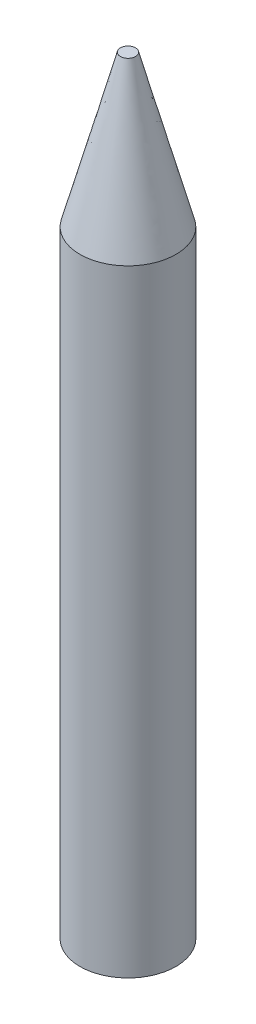
ISO-10303-21;
HEADER;
FILE_DESCRIPTION(('STEP AP214'),'2;1');
FILE_NAME('part.step','',(''),(''),'','','');
FILE_SCHEMA(('AUTOMOTIVE_DESIGN { 1 0 10303 214 1 1 1 1 }'));
ENDSEC;
DATA;
#1=APPLICATION_CONTEXT('core data for automotive mechanical design processes');
#2=APPLICATION_PROTOCOL_DEFINITION('international standard','automotive_design',2000,#1);
#3=PRODUCT_CONTEXT('',#1,'mechanical');
#4=PRODUCT('Part','Part','',(#3));
#5=PRODUCT_RELATED_PRODUCT_CATEGORY('part','',(#4));
#6=PRODUCT_DEFINITION_FORMATION('','',#4);
#7=PRODUCT_DEFINITION_CONTEXT('part definition',#1,'design');
#8=PRODUCT_DEFINITION('design','',#6,#7);
#9=PRODUCT_DEFINITION_SHAPE('','',#8);
#10=(LENGTH_UNIT() NAMED_UNIT(*) SI_UNIT(.MILLI.,.METRE.));
#11=(NAMED_UNIT(*) PLANE_ANGLE_UNIT() SI_UNIT($,.RADIAN.));
#12=(NAMED_UNIT(*) SI_UNIT($,.STERADIAN.) SOLID_ANGLE_UNIT());
#13=UNCERTAINTY_MEASURE_WITH_UNIT(LENGTH_MEASURE(1.E-05),#10,'distance_accuracy_value','');
#14=(GEOMETRIC_REPRESENTATION_CONTEXT(3) GLOBAL_UNCERTAINTY_ASSIGNED_CONTEXT((#13)) GLOBAL_UNIT_ASSIGNED_CONTEXT((#10,
#11,#12)) REPRESENTATION_CONTEXT('',''));
#15=CARTESIAN_POINT('',(0.,0.,0.));
#16=DIRECTION('',(0.,0.,1.));
#17=DIRECTION('',(1.,0.,0.));
#18=AXIS2_PLACEMENT_3D('',#15,#16,#17);
#19=CARTESIAN_POINT('',(0.,40.8,0.));
#20=DIRECTION('',(0.,-1.,0.));
#21=DIRECTION('',(0.,0.,-1.));
#22=AXIS2_PLACEMENT_3D('',#19,#20,#21);
#23=CYLINDRICAL_SURFACE('',#22,3.175);
#24=CARTESIAN_POINT('',(0.,40.8,0.));
#25=DIRECTION('',(0.,-1.,0.));
#26=DIRECTION('',(0.,0.,-1.));
#27=AXIS2_PLACEMENT_3D('',#24,#25,#26);
#28=CIRCLE('',#27,3.175);
#29=CARTESIAN_POINT('',(1.16879545477385,40.8,2.9520403426952));
#30=VERTEX_POINT('',#29);
#31=EDGE_CURVE('E11',#30,#30,#28,.F.);
#32=ORIENTED_EDGE('',*,*,#31,.F.);
#33=EDGE_LOOP('',(#32));
#34=FACE_BOUND('',#33,.T.);
#35=CARTESIAN_POINT('',(0.,0.,0.));
#36=DIRECTION('',(0.,1.,0.));
#37=DIRECTION('',(0.,0.,1.));
#38=AXIS2_PLACEMENT_3D('',#35,#36,#37);
#39=CIRCLE('',#38,3.175);
#40=CARTESIAN_POINT('',(0.,0.,3.175));
#41=VERTEX_POINT('',#40);
#42=EDGE_CURVE('E44',#41,#41,#39,.T.);
#43=ORIENTED_EDGE('',*,*,#42,.T.);
#44=EDGE_LOOP('',(#43));
#45=FACE_BOUND('',#44,.T.);
#46=ADVANCED_FACE('F37',(#34,#45),#23,.T.);
#47=CARTESIAN_POINT('',(0.,0.,0.));
#48=DIRECTION('',(0.,1.,0.));
#49=DIRECTION('',(0.,0.,1.));
#50=AXIS2_PLACEMENT_3D('',#47,#48,#49);
#51=PLANE('',#50);
#52=ORIENTED_EDGE('',*,*,#42,.F.);
#53=EDGE_LOOP('',(#52));
#54=FACE_BOUND('',#53,.T.);
#55=ADVANCED_FACE('F70',(#54),#51,.F.);
#56=CARTESIAN_POINT('',(0.,50.8,0.));
#57=DIRECTION('',(0.,1.,0.));
#58=DIRECTION('',(0.,0.,1.));
#59=AXIS2_PLACEMENT_3D('',#56,#57,#58);
#60=PLANE('',#59);
#61=CARTESIAN_POINT('',(0.,50.8,0.));
#62=DIRECTION('',(0.,1.,0.));
#63=DIRECTION('',(0.,0.,1.));
#64=AXIS2_PLACEMENT_3D('',#61,#62,#63);
#65=CIRCLE('',#64,0.5);
#66=CARTESIAN_POINT('',(0.0794581499561334,50.8,0.493646029463976));
#67=VERTEX_POINT('',#66);
#68=EDGE_CURVE('E48',#67,#67,#65,.T.);
#69=ORIENTED_EDGE('',*,*,#68,.T.);
#70=EDGE_LOOP('',(#69));
#71=FACE_BOUND('',#70,.T.);
#72=ADVANCED_FACE('F60',(#71),#60,.T.);
#73=CARTESIAN_POINT('',(1.16879545477385,40.8,2.9520403426952));
#74=CARTESIAN_POINT('',(0.0794581499561334,50.8,0.493646029463976));
#75=CARTESIAN_POINT('',(7.07287614016425,40.8,0.614449433147494));
#76=CARTESIAN_POINT('',(1.06675020888409,50.8,0.334729729551709));
#77=CARTESIAN_POINT('',(4.73528523061655,40.8,-5.2896312522429));
#78=CARTESIAN_POINT('',(0.907833908971818,50.8,-0.652562329376243));
#79=CARTESIAN_POINT('',(-1.16879545477385,40.8,-2.9520403426952));
#80=CARTESIAN_POINT('',(-0.0794581499561334,50.8,-0.493646029463976));
#81=CARTESIAN_POINT('',(-7.07287614016425,40.8,-0.614449433147496));
#82=CARTESIAN_POINT('',(-1.06675020888408,50.8,-0.334729729551709));
#83=CARTESIAN_POINT('',(-4.73528523061654,40.8,5.2896312522429));
#84=CARTESIAN_POINT('',(-0.907833908971818,50.8,0.652562329376242));
#85=CARTESIAN_POINT('',(1.16879545477385,40.8,2.9520403426952));
#86=CARTESIAN_POINT('',(0.0794581499561334,50.8,0.493646029463976));
#87=(BOUNDED_SURFACE() B_SPLINE_SURFACE(3,1,((#73,#74),(#75,#76),(#77,#78),(#79,#80),(#81,#82),
(#83,#84),(#85,#86)),.UNSPECIFIED.,.T.,.F.,.F.) B_SPLINE_SURFACE_WITH_KNOTS((4,3,4),(2,2),(0.,
0.5,1.),(0.,1.),.UNSPECIFIED.) GEOMETRIC_REPRESENTATION_ITEM() RATIONAL_B_SPLINE_SURFACE(((1.,
1.),(0.333333333333333,0.333333333333333),(0.333333333333333,0.333333333333333),(1.,1.),
(0.333333333333334,0.333333333333334),(0.333333333333334,0.333333333333334),(1.,1.))) REPRESENTATION_ITEM('') SURFACE());
#88=CARTESIAN_POINT('',(1.16879545477385,40.8,2.9520403426952));
#89=CARTESIAN_POINT('',(1.157448191182,40.9041666666667,2.92643206859904));
#90=CARTESIAN_POINT('',(1.14610092759015,41.0083333333333,2.90082379450288));
#91=CARTESIAN_POINT('',(1.12340640040645,41.2166666666667,2.84960724631057));
#92=CARTESIAN_POINT('',(1.1120591368146,41.3208333333333,2.82399897221441));
#93=CARTESIAN_POINT('',(1.08936460963089,41.5291666666667,2.77278242402209));
#94=CARTESIAN_POINT('',(1.07801734603904,41.6333333333333,2.74717414992593));
#95=CARTESIAN_POINT('',(1.05532281885534,41.8416666666667,2.69595760173361));
#96=CARTESIAN_POINT('',(1.04397555526349,41.9458333333333,2.67034932763746));
#97=CARTESIAN_POINT('',(1.02128102807979,42.1541666666667,2.61913277944514));
#98=CARTESIAN_POINT('',(1.00993376448794,42.2583333333333,2.59352450534898));
#99=CARTESIAN_POINT('',(0.987239237304233,42.4666666666667,2.54230795715666));
#100=CARTESIAN_POINT('',(0.975891973712382,42.5708333333333,2.5166996830605));
#101=CARTESIAN_POINT('',(0.953197446528679,42.7791666666667,2.46548313486819));
#102=CARTESIAN_POINT('',(0.941850182936828,42.8833333333333,2.43987486077203));
#103=CARTESIAN_POINT('',(0.919155655753125,43.0916666666667,2.38865831257971));
#104=CARTESIAN_POINT('',(0.907808392161274,43.1958333333333,2.36305003848355));
#105=CARTESIAN_POINT('',(0.885113864977572,43.4041666666667,2.31183349029123));
#106=CARTESIAN_POINT('',(0.873766601385721,43.5083333333333,2.28622521619508));
#107=CARTESIAN_POINT('',(0.851072074202018,43.7166666666667,2.23500866800276));
#108=CARTESIAN_POINT('',(0.839724810610167,43.8208333333333,2.2094003939066));
#109=CARTESIAN_POINT('',(0.817030283426464,44.0291666666667,2.15818384571428));
#110=CARTESIAN_POINT('',(0.805683019834613,44.1333333333333,2.13257557161813));
#111=CARTESIAN_POINT('',(0.782988492650911,44.3416666666667,2.08135902342581));
#112=CARTESIAN_POINT('',(0.771641229059059,44.4458333333333,2.05575074932965));
#113=CARTESIAN_POINT('',(0.748946701875357,44.6541666666667,2.00453420113733));
#114=CARTESIAN_POINT('',(0.737599438283506,44.7583333333333,1.97892592704117));
#115=CARTESIAN_POINT('',(0.714904911099803,44.9666666666667,1.92770937884886));
#116=CARTESIAN_POINT('',(0.703557647507951,45.0708333333333,1.9021011047527));
#117=CARTESIAN_POINT('',(0.680863120324249,45.2791666666667,1.85088455656038));
#118=CARTESIAN_POINT('',(0.669515856732398,45.3833333333333,1.82527628246422));
#119=CARTESIAN_POINT('',(0.646821329548696,45.5916666666667,1.77405973427191));
#120=CARTESIAN_POINT('',(0.635474065956844,45.6958333333333,1.74845146017575));
#121=CARTESIAN_POINT('',(0.612779538773142,45.9041666666667,1.69723491198343));
#122=CARTESIAN_POINT('',(0.601432275181291,46.0083333333333,1.67162663788727));
#123=CARTESIAN_POINT('',(0.578737747997588,46.2166666666667,1.62041008969495));
#124=CARTESIAN_POINT('',(0.567390484405737,46.3208333333333,1.59480181559879));
#125=CARTESIAN_POINT('',(0.544695957222034,46.5291666666667,1.54358526740648));
#126=CARTESIAN_POINT('',(0.533348693630183,46.6333333333333,1.51797699331032));
#127=CARTESIAN_POINT('',(0.510654166446481,46.8416666666667,1.466760445118));
#128=CARTESIAN_POINT('',(0.499306902854629,46.9458333333333,1.44115217102184));
#129=CARTESIAN_POINT('',(0.476612375670927,47.1541666666667,1.38993562282953));
#130=CARTESIAN_POINT('',(0.465265112079076,47.2583333333333,1.36432734873337));
#131=CARTESIAN_POINT('',(0.442570584895373,47.4666666666667,1.31311080054105));
#132=CARTESIAN_POINT('',(0.431223321303522,47.5708333333333,1.28750252644489));
#133=CARTESIAN_POINT('',(0.408528794119819,47.7791666666667,1.23628597825257));
#134=CARTESIAN_POINT('',(0.397181530527968,47.8833333333333,1.21067770415642));
#135=CARTESIAN_POINT('',(0.374487003344266,48.0916666666667,1.1594611559641));
#136=CARTESIAN_POINT('',(0.363139739752414,48.1958333333333,1.13385288186794));
#137=CARTESIAN_POINT('',(0.340445212568712,48.4041666666667,1.08263633367562));
#138=CARTESIAN_POINT('',(0.329097948976861,48.5083333333333,1.05702805957947));
#139=CARTESIAN_POINT('',(0.306403421793158,48.7166666666667,1.00581151138715));
#140=CARTESIAN_POINT('',(0.295056158201307,48.8208333333333,0.980203237290989));
#141=CARTESIAN_POINT('',(0.272361631017604,49.0291666666667,0.928986689098671));
#142=CARTESIAN_POINT('',(0.261014367425753,49.1333333333333,0.903378415002513));
#143=CARTESIAN_POINT('',(0.238319840242051,49.3416666666667,0.852161866810196));
#144=CARTESIAN_POINT('',(0.2269725766502,49.4458333333333,0.826553592714038));
#145=CARTESIAN_POINT('',(0.204278049466497,49.6541666666667,0.77533704452172));
#146=CARTESIAN_POINT('',(0.192930785874646,49.7583333333333,0.749728770425562));
#147=CARTESIAN_POINT('',(0.170236258690943,49.9666666666667,0.698512222233244));
#148=CARTESIAN_POINT('',(0.158888995099092,50.0708333333333,0.672903948137086));
#149=CARTESIAN_POINT('',(0.13619446791539,50.2791666666667,0.621687399944769));
#150=CARTESIAN_POINT('',(0.124847204323538,50.3833333333333,0.59607912584861));
#151=CARTESIAN_POINT('',(0.102152677139836,50.5916666666667,0.544862577656293));
#152=CARTESIAN_POINT('',(0.0908054135479846,50.6958333333333,0.519254303560134));
#153=CARTESIAN_POINT('',(0.0794581499561334,50.8,0.493646029463976));
#154=B_SPLINE_CURVE_WITH_KNOTS('',3,(#88,#89,#90,#91,#92,#93,#94,#95,#96,#97,#98,#99,#100,#101,
#102,#103,#104,#105,#106,#107,#108,#109,#110,#111,#112,#113,#114,#115,#116,#117,#118,#119,#120,
#121,#122,#123,#124,#125,#126,#127,#128,#129,#130,#131,#132,#133,#134,#135,#136,#137,#138,#139,
#140,#141,#142,#143,#144,#145,#146,#147,#148,#149,#150,#151,#152,#153),.UNSPECIFIED.,.F.,.F.,(4,
2,2,2,2,2,2,2,2,2,2,2,2,2,2,2,2,2,2,2,2,2,2,2,2,2,2,2,2,2,2,2,4),(0.,0.323600288687854,
0.647200577375709,0.970800866063563,1.29440115475142,1.61800144343927,1.94160173212713,
2.26520202081497,2.58880230950283,2.91240259819069,3.23600288687854,3.5596031755664,
3.88320346425424,4.20680375294211,4.53040404162995,4.85400433031781,5.17760461900566,
5.50120490769352,5.82480519638137,6.14840548506923,6.47200577375708,6.79560606244494,
7.11920635113279,7.44280663982064,7.7664069285085,8.09000721719636,8.4136075058842,
8.73720779457206,9.06080808325991,9.38440837194777,9.70800866063562,10.0316089493235,
10.3552092380113),.UNSPECIFIED.);
#155=EDGE_CURVE('BSEAM69',#30,#67,#154,.T.);
#156=ORIENTED_EDGE('',*,*,#31,.T.);
#157=ORIENTED_EDGE('',*,*,#68,.F.);
#158=ORIENTED_EDGE('',*,*,#155,.T.);
#159=ORIENTED_EDGE('',*,*,#155,.F.);
#160=EDGE_LOOP('',(#156,#158,#157,#159));
#161=FACE_BOUND('',#160,.T.);
#162=ADVANCED_FACE('F69',(#161),#87,.T.);
#163=CLOSED_SHELL('',(#46,#55,#72,#162));
#164=MANIFOLD_SOLID_BREP('B2',#163);
#165=ADVANCED_BREP_SHAPE_REPRESENTATION('',(#18,#164),#14);
#166=SHAPE_DEFINITION_REPRESENTATION(#9,#165);
ENDSEC;
END-ISO-10303-21;
